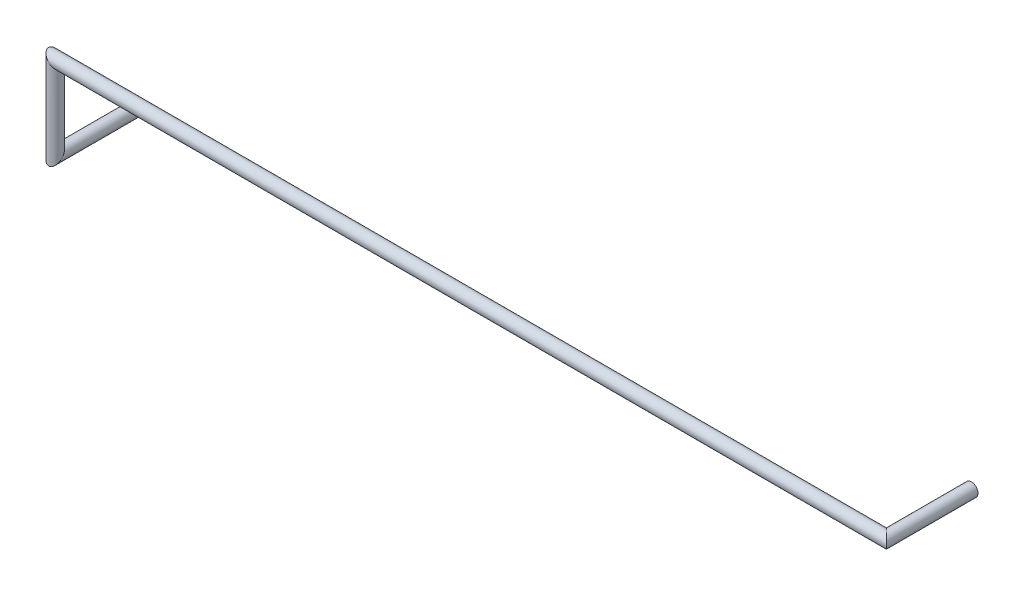
ISO-10303-21;
HEADER;
FILE_DESCRIPTION(('STEP AP214'),'2;1');
FILE_NAME('part.step','',(''),(''),'','','');
FILE_SCHEMA(('AUTOMOTIVE_DESIGN { 1 0 10303 214 1 1 1 1 }'));
ENDSEC;
DATA;
#1=APPLICATION_CONTEXT('core data for automotive mechanical design processes');
#2=APPLICATION_PROTOCOL_DEFINITION('international standard','automotive_design',2000,#1);
#3=PRODUCT_CONTEXT('',#1,'mechanical');
#4=PRODUCT('Part','Part','',(#3));
#5=PRODUCT_RELATED_PRODUCT_CATEGORY('part','',(#4));
#6=PRODUCT_DEFINITION_FORMATION('','',#4);
#7=PRODUCT_DEFINITION_CONTEXT('part definition',#1,'design');
#8=PRODUCT_DEFINITION('design','',#6,#7);
#9=PRODUCT_DEFINITION_SHAPE('','',#8);
#10=(LENGTH_UNIT() NAMED_UNIT(*) SI_UNIT(.MILLI.,.METRE.));
#11=(NAMED_UNIT(*) PLANE_ANGLE_UNIT() SI_UNIT($,.RADIAN.));
#12=(NAMED_UNIT(*) SI_UNIT($,.STERADIAN.) SOLID_ANGLE_UNIT());
#13=UNCERTAINTY_MEASURE_WITH_UNIT(LENGTH_MEASURE(1.E-05),#10,'distance_accuracy_value','');
#14=(GEOMETRIC_REPRESENTATION_CONTEXT(3) GLOBAL_UNCERTAINTY_ASSIGNED_CONTEXT((#13)) GLOBAL_UNIT_ASSIGNED_CONTEXT((#10,
#11,#12)) REPRESENTATION_CONTEXT('',''));
#15=CARTESIAN_POINT('',(0.,0.,0.));
#16=DIRECTION('',(0.,0.,1.));
#17=DIRECTION('',(1.,0.,0.));
#18=AXIS2_PLACEMENT_3D('',#15,#16,#17);
#19=CARTESIAN_POINT('',(25.4,2.54,0.));
#20=DIRECTION('',(0.,0.,1.));
#21=DIRECTION('',(1.,0.,0.));
#22=AXIS2_PLACEMENT_3D('',#19,#20,#21);
#23=PLANE('',#22);
#24=CARTESIAN_POINT('',(25.4,2.54,0.));
#25=DIRECTION('',(0.,0.,1.));
#26=DIRECTION('',(1.,0.,0.));
#27=AXIS2_PLACEMENT_3D('',#24,#25,#26);
#28=CIRCLE('',#27,0.199999999999999);
#29=CARTESIAN_POINT('',(25.6,2.54,0.));
#30=VERTEX_POINT('',#29);
#31=EDGE_CURVE('E52',#30,#30,#28,.T.);
#32=ORIENTED_EDGE('',*,*,#31,.F.);
#33=EDGE_LOOP('',(#32));
#34=FACE_BOUND('',#33,.T.);
#35=ADVANCED_FACE('F49',(#34),#23,.F.);
#36=CARTESIAN_POINT('',(0.,0.,0.));
#37=DIRECTION('',(0.,0.,-1.));
#38=DIRECTION('',(0.,-1.,0.));
#39=AXIS2_PLACEMENT_3D('',#36,#37,#38);
#40=PLANE('',#39);
#41=CARTESIAN_POINT('',(0.,0.,0.));
#42=DIRECTION('',(0.,0.,-1.));
#43=DIRECTION('',(0.,-1.,0.));
#44=AXIS2_PLACEMENT_3D('',#41,#42,#43);
#45=CIRCLE('',#44,0.199999999999999);
#46=CARTESIAN_POINT('',(0.,-0.199999999999999,0.));
#47=VERTEX_POINT('',#46);
#48=EDGE_CURVE('E57',#47,#47,#45,.T.);
#49=ORIENTED_EDGE('',*,*,#48,.T.);
#50=EDGE_LOOP('',(#49));
#51=FACE_BOUND('',#50,.T.);
#52=ADVANCED_FACE('F80',(#51),#40,.T.);
#53=CARTESIAN_POINT('',(25.4,2.54,2.92));
#54=DIRECTION('',(0.,0.,-1.));
#55=DIRECTION('',(-1.,0.,0.));
#56=AXIS2_PLACEMENT_3D('',#53,#54,#55);
#57=CYLINDRICAL_SURFACE('',#56,0.199999999999999);
#58=CARTESIAN_POINT('',(25.4,2.54,2.6));
#59=DIRECTION('',(0.707106781186548,0.,-0.707106781186548));
#60=DIRECTION('',(0.707106781186548,0.,0.707106781186548));
#61=AXIS2_PLACEMENT_3D('',#58,#59,#60);
#62=ELLIPSE('',#61,0.282842712474617,0.199999999999999);
#63=CARTESIAN_POINT('',(25.6,2.54,2.8));
#64=VERTEX_POINT('',#63);
#65=EDGE_CURVE('E68',#64,#64,#62,.T.);
#66=ORIENTED_EDGE('',*,*,#65,.T.);
#67=EDGE_LOOP('',(#66));
#68=FACE_BOUND('',#67,.T.);
#69=ORIENTED_EDGE('',*,*,#31,.T.);
#70=EDGE_LOOP('',(#69));
#71=FACE_BOUND('',#70,.T.);
#72=ADVANCED_FACE('F77',(#68,#71),#57,.T.);
#73=CARTESIAN_POINT('',(-0.539999999999998,2.54,2.6));
#74=DIRECTION('',(1.,0.,0.));
#75=DIRECTION('',(0.,0.,-1.));
#76=AXIS2_PLACEMENT_3D('',#73,#74,#75);
#77=CYLINDRICAL_SURFACE('',#76,0.199999999999999);
#78=CARTESIAN_POINT('',(0.,2.54,2.6));
#79=DIRECTION('',(0.707106781186548,0.707106781186548,0.));
#80=DIRECTION('',(-0.707106781186548,0.707106781186548,0.));
#81=AXIS2_PLACEMENT_3D('',#78,#79,#80);
#82=ELLIPSE('',#81,0.282842712474617,0.199999999999999);
#83=CARTESIAN_POINT('',(-0.199999999999999,2.74,2.6));
#84=VERTEX_POINT('',#83);
#85=EDGE_CURVE('E63',#84,#84,#82,.T.);
#86=ORIENTED_EDGE('',*,*,#85,.T.);
#87=EDGE_LOOP('',(#86));
#88=FACE_BOUND('',#87,.T.);
#89=ORIENTED_EDGE('',*,*,#65,.F.);
#90=EDGE_LOOP('',(#89));
#91=FACE_BOUND('',#90,.T.);
#92=ADVANCED_FACE('F93',(#88,#91),#77,.T.);
#93=CARTESIAN_POINT('',(0.,-0.319999999999997,2.6));
#94=DIRECTION('',(0.,1.,0.));
#95=DIRECTION('',(-1.,0.,0.));
#96=AXIS2_PLACEMENT_3D('',#93,#94,#95);
#97=CYLINDRICAL_SURFACE('',#96,0.199999999999999);
#98=CARTESIAN_POINT('',(0.,0.,2.6));
#99=DIRECTION('',(0.,0.707106781186548,0.707106781186548));
#100=DIRECTION('',(0.,-0.707106781186548,0.707106781186548));
#101=AXIS2_PLACEMENT_3D('',#98,#99,#100);
#102=ELLIPSE('',#101,0.282842712474617,0.199999999999999);
#103=CARTESIAN_POINT('',(0.,-0.199999999999999,2.8));
#104=VERTEX_POINT('',#103);
#105=EDGE_CURVE('E11',#104,#104,#102,.T.);
#106=ORIENTED_EDGE('',*,*,#105,.T.);
#107=EDGE_LOOP('',(#106));
#108=FACE_BOUND('',#107,.T.);
#109=ORIENTED_EDGE('',*,*,#85,.F.);
#110=EDGE_LOOP('',(#109));
#111=FACE_BOUND('',#110,.T.);
#112=ADVANCED_FACE('F87',(#108,#111),#97,.T.);
#113=CARTESIAN_POINT('',(0.,0.,0.));
#114=DIRECTION('',(0.,0.,1.));
#115=DIRECTION('',(1.,0.,0.));
#116=AXIS2_PLACEMENT_3D('',#113,#114,#115);
#117=CYLINDRICAL_SURFACE('',#116,0.199999999999999);
#118=ORIENTED_EDGE('',*,*,#48,.F.);
#119=EDGE_LOOP('',(#118));
#120=FACE_BOUND('',#119,.T.);
#121=ORIENTED_EDGE('',*,*,#105,.F.);
#122=EDGE_LOOP('',(#121));
#123=FACE_BOUND('',#122,.T.);
#124=ADVANCED_FACE('F85',(#120,#123),#117,.T.);
#125=CLOSED_SHELL('',(#35,#52,#72,#92,#112,#124));
#126=MANIFOLD_SOLID_BREP('B2',#125);
#127=ADVANCED_BREP_SHAPE_REPRESENTATION('',(#18,#126),#14);
#128=SHAPE_DEFINITION_REPRESENTATION(#9,#127);
ENDSEC;
END-ISO-10303-21;
